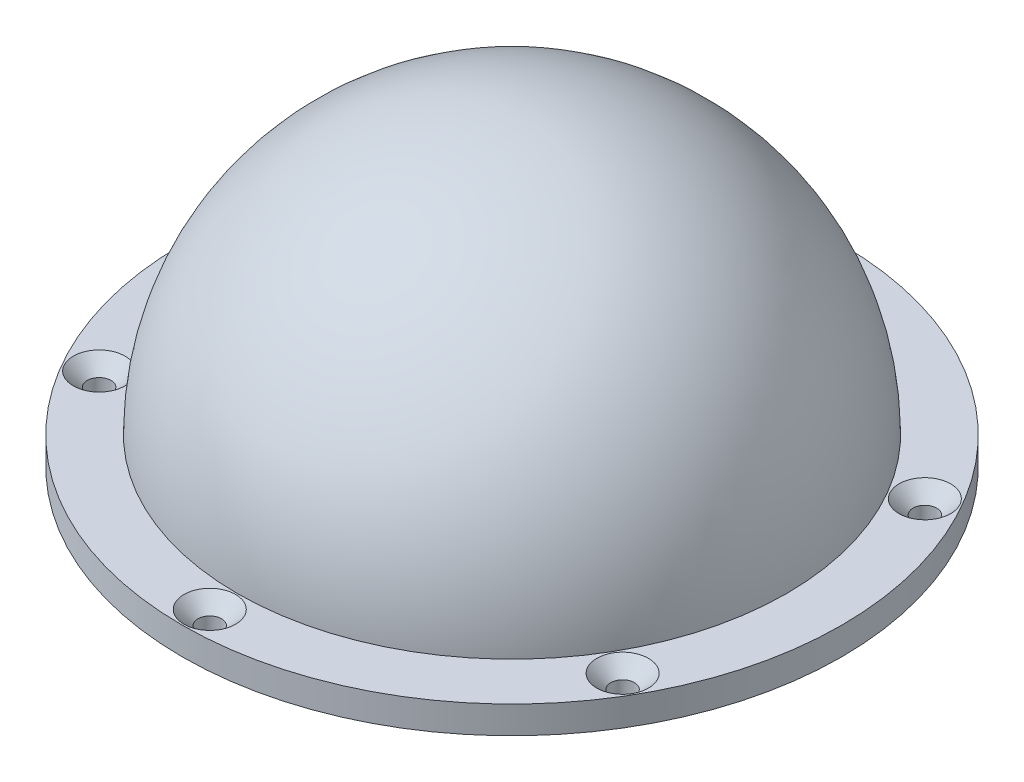
ISO-10303-21;
HEADER;
FILE_DESCRIPTION(('STEP AP214'),'2;1');
FILE_NAME('part.step','',(''),(''),'','','');
FILE_SCHEMA(('AUTOMOTIVE_DESIGN { 1 0 10303 214 1 1 1 1 }'));
ENDSEC;
DATA;
#1=APPLICATION_CONTEXT('core data for automotive mechanical design processes');
#2=APPLICATION_PROTOCOL_DEFINITION('international standard','automotive_design',2000,#1);
#3=PRODUCT_CONTEXT('',#1,'mechanical');
#4=PRODUCT('Part','Part','',(#3));
#5=PRODUCT_RELATED_PRODUCT_CATEGORY('part','',(#4));
#6=PRODUCT_DEFINITION_FORMATION('','',#4);
#7=PRODUCT_DEFINITION_CONTEXT('part definition',#1,'design');
#8=PRODUCT_DEFINITION('design','',#6,#7);
#9=PRODUCT_DEFINITION_SHAPE('','',#8);
#10=(LENGTH_UNIT() NAMED_UNIT(*) SI_UNIT(.MILLI.,.METRE.));
#11=(NAMED_UNIT(*) PLANE_ANGLE_UNIT() SI_UNIT($,.RADIAN.));
#12=(NAMED_UNIT(*) SI_UNIT($,.STERADIAN.) SOLID_ANGLE_UNIT());
#13=UNCERTAINTY_MEASURE_WITH_UNIT(LENGTH_MEASURE(1.E-05),#10,'distance_accuracy_value','');
#14=(GEOMETRIC_REPRESENTATION_CONTEXT(3) GLOBAL_UNCERTAINTY_ASSIGNED_CONTEXT((#13)) GLOBAL_UNIT_ASSIGNED_CONTEXT((#10,
#11,#12)) REPRESENTATION_CONTEXT('',''));
#15=CARTESIAN_POINT('',(0.,0.,0.));
#16=DIRECTION('',(0.,0.,1.));
#17=DIRECTION('',(1.,0.,0.));
#18=AXIS2_PLACEMENT_3D('',#15,#16,#17);
#19=CARTESIAN_POINT('',(0.,50.,0.));
#20=DIRECTION('',(0.,1.,0.));
#21=DIRECTION('',(-1.,0.,0.));
#22=AXIS2_PLACEMENT_3D('',#19,#20,#21);
#23=CYLINDRICAL_SURFACE('',#22,60.);
#24=CARTESIAN_POINT('',(0.,0.,0.));
#25=DIRECTION('',(0.,1.,0.));
#26=DIRECTION('',(-1.,0.,0.));
#27=AXIS2_PLACEMENT_3D('',#24,#25,#26);
#28=CIRCLE('',#27,60.);
#29=CARTESIAN_POINT('',(-60.,0.,0.));
#30=VERTEX_POINT('',#29);
#31=EDGE_CURVE('E10',#30,#30,#28,.T.);
#32=ORIENTED_EDGE('',*,*,#31,.F.);
#33=EDGE_LOOP('',(#32));
#34=FACE_BOUND('',#33,.T.);
#35=CARTESIAN_POINT('',(0.,-4.99999999999999,0.));
#36=DIRECTION('',(0.,1.,0.));
#37=DIRECTION('',(-1.,0.,0.));
#38=AXIS2_PLACEMENT_3D('',#35,#36,#37);
#39=CIRCLE('',#38,60.);
#40=CARTESIAN_POINT('',(-60.,-5.,0.));
#41=VERTEX_POINT('',#40);
#42=EDGE_CURVE('E39',#41,#41,#39,.T.);
#43=ORIENTED_EDGE('',*,*,#42,.T.);
#44=EDGE_LOOP('',(#43));
#45=FACE_BOUND('',#44,.T.);
#46=ADVANCED_FACE('F29',(#34,#45),#23,.T.);
#47=CARTESIAN_POINT('',(50.,0.,0.));
#48=DIRECTION('',(0.,-1.,0.));
#49=DIRECTION('',(1.,0.,0.));
#50=AXIS2_PLACEMENT_3D('',#47,#48,#49);
#51=PLANE('',#50);
#52=CARTESIAN_POINT('',(47.6313972081438,0.,-27.5000000000006));
#53=DIRECTION('',(0.,1.,0.));
#54=DIRECTION('',(0.,0.,1.));
#55=AXIS2_PLACEMENT_3D('',#52,#53,#54);
#56=CIRCLE('',#55,4.7);
#57=CARTESIAN_POINT('',(47.6313972081438,0.,-22.8000000000006));
#58=VERTEX_POINT('',#57);
#59=EDGE_CURVE('E90',#58,#58,#56,.T.);
#60=ORIENTED_EDGE('',*,*,#59,.F.);
#61=EDGE_LOOP('',(#60));
#62=FACE_BOUND('',#61,.T.);
#63=CARTESIAN_POINT('',(47.6313972081444,0.,27.4999999999996));
#64=DIRECTION('',(0.,1.,0.));
#65=DIRECTION('',(0.,0.,1.));
#66=AXIS2_PLACEMENT_3D('',#63,#64,#65);
#67=CIRCLE('',#66,4.7);
#68=CARTESIAN_POINT('',(47.6313972081444,0.,32.1999999999996));
#69=VERTEX_POINT('',#68);
#70=EDGE_CURVE('E81',#69,#69,#67,.T.);
#71=ORIENTED_EDGE('',*,*,#70,.F.);
#72=EDGE_LOOP('',(#71));
#73=FACE_BOUND('',#72,.T.);
#74=CARTESIAN_POINT('',(3.84063169722032E-13,0.,55.));
#75=DIRECTION('',(0.,1.,0.));
#76=DIRECTION('',(0.,0.,1.));
#77=AXIS2_PLACEMENT_3D('',#74,#75,#76);
#78=CIRCLE('',#77,4.7);
#79=CARTESIAN_POINT('',(3.84063169722032E-13,0.,59.7));
#80=VERTEX_POINT('',#79);
#81=EDGE_CURVE('E72',#80,#80,#78,.T.);
#82=ORIENTED_EDGE('',*,*,#81,.F.);
#83=EDGE_LOOP('',(#82));
#84=FACE_BOUND('',#83,.T.);
#85=CARTESIAN_POINT('',(-47.631397208144,0.,27.5000000000002));
#86=DIRECTION('',(0.,1.,0.));
#87=DIRECTION('',(0.,0.,1.));
#88=AXIS2_PLACEMENT_3D('',#85,#86,#87);
#89=CIRCLE('',#88,4.7);
#90=CARTESIAN_POINT('',(-47.631397208144,0.,32.2000000000002));
#91=VERTEX_POINT('',#90);
#92=EDGE_CURVE('E63',#91,#91,#89,.T.);
#93=ORIENTED_EDGE('',*,*,#92,.F.);
#94=EDGE_LOOP('',(#93));
#95=FACE_BOUND('',#94,.T.);
#96=CARTESIAN_POINT('',(-47.6313972081442,0.,-27.4999999999999));
#97=DIRECTION('',(0.,1.,0.));
#98=DIRECTION('',(0.,0.,1.));
#99=AXIS2_PLACEMENT_3D('',#96,#97,#98);
#100=CIRCLE('',#99,4.7);
#101=CARTESIAN_POINT('',(-47.6313972081442,0.,-22.7999999999999));
#102=VERTEX_POINT('',#101);
#103=EDGE_CURVE('E54',#102,#102,#100,.T.);
#104=ORIENTED_EDGE('',*,*,#103,.F.);
#105=EDGE_LOOP('',(#104));
#106=FACE_BOUND('',#105,.T.);
#107=CARTESIAN_POINT('',(0.,0.,-55.));
#108=DIRECTION('',(0.,1.,0.));
#109=DIRECTION('',(0.,0.,1.));
#110=AXIS2_PLACEMENT_3D('',#107,#108,#109);
#111=CIRCLE('',#110,4.7);
#112=CARTESIAN_POINT('',(0.,0.,-50.3));
#113=VERTEX_POINT('',#112);
#114=EDGE_CURVE('E43',#113,#113,#111,.T.);
#115=ORIENTED_EDGE('',*,*,#114,.F.);
#116=EDGE_LOOP('',(#115));
#117=FACE_BOUND('',#116,.T.);
#118=CARTESIAN_POINT('',(0.,0.,0.));
#119=DIRECTION('',(0.,1.,0.));
#120=DIRECTION('',(-1.,0.,0.));
#121=AXIS2_PLACEMENT_3D('',#118,#119,#120);
#122=CIRCLE('',#121,50.);
#123=CARTESIAN_POINT('',(-50.,0.,0.));
#124=VERTEX_POINT('',#123);
#125=EDGE_CURVE('E35',#124,#124,#122,.T.);
#126=ORIENTED_EDGE('',*,*,#125,.F.);
#127=EDGE_LOOP('',(#126));
#128=FACE_BOUND('',#127,.T.);
#129=ORIENTED_EDGE('',*,*,#31,.T.);
#130=EDGE_LOOP('',(#129));
#131=FACE_BOUND('',#130,.T.);
#132=ADVANCED_FACE('F116',(#62,#73,#84,#95,#106,#117,#128,#131),#51,.F.);
#133=CARTESIAN_POINT('',(0.,0.,0.));
#134=DIRECTION('',(0.,1.,0.));
#135=DIRECTION('',(1.,0.,0.));
#136=AXIS2_PLACEMENT_3D('',#133,#134,#135);
#137=SPHERICAL_SURFACE('',#136,50.);
#138=ORIENTED_EDGE('',*,*,#125,.T.);
#139=EDGE_LOOP('',(#138));
#140=FACE_BOUND('',#139,.T.);
#141=ADVANCED_FACE('F119',(#140),#137,.T.);
#142=CARTESIAN_POINT('',(0.,-4.99999999999999,0.));
#143=DIRECTION('',(0.,1.,0.));
#144=DIRECTION('',(-1.,0.,0.));
#145=AXIS2_PLACEMENT_3D('',#142,#143,#144);
#146=PLANE('',#145);
#147=CARTESIAN_POINT('',(47.6313972081438,-4.99999999999999,-27.5000000000006));
#148=DIRECTION('',(0.,1.,0.));
#149=DIRECTION('',(0.,0.,1.));
#150=AXIS2_PLACEMENT_3D('',#147,#148,#149);
#151=CIRCLE('',#150,2.15);
#152=CARTESIAN_POINT('',(47.6313972081438,-4.99999999999999,-25.3500000000006));
#153=VERTEX_POINT('',#152);
#154=EDGE_CURVE('E96',#153,#153,#151,.T.);
#155=ORIENTED_EDGE('',*,*,#154,.T.);
#156=EDGE_LOOP('',(#155));
#157=FACE_BOUND('',#156,.T.);
#158=CARTESIAN_POINT('',(47.6313972081444,-4.99999999999999,27.4999999999996));
#159=DIRECTION('',(0.,1.,0.));
#160=DIRECTION('',(0.,0.,1.));
#161=AXIS2_PLACEMENT_3D('',#158,#159,#160);
#162=CIRCLE('',#161,2.15);
#163=CARTESIAN_POINT('',(47.6313972081444,-4.99999999999999,29.6499999999996));
#164=VERTEX_POINT('',#163);
#165=EDGE_CURVE('E87',#164,#164,#162,.T.);
#166=ORIENTED_EDGE('',*,*,#165,.T.);
#167=EDGE_LOOP('',(#166));
#168=FACE_BOUND('',#167,.T.);
#169=CARTESIAN_POINT('',(3.84063169722032E-13,-4.99999999999999,55.));
#170=DIRECTION('',(0.,1.,0.));
#171=DIRECTION('',(0.,0.,1.));
#172=AXIS2_PLACEMENT_3D('',#169,#170,#171);
#173=CIRCLE('',#172,2.15);
#174=CARTESIAN_POINT('',(3.84063169722032E-13,-4.99999999999999,57.15));
#175=VERTEX_POINT('',#174);
#176=EDGE_CURVE('E78',#175,#175,#173,.T.);
#177=ORIENTED_EDGE('',*,*,#176,.T.);
#178=EDGE_LOOP('',(#177));
#179=FACE_BOUND('',#178,.T.);
#180=CARTESIAN_POINT('',(-47.631397208144,-4.99999999999999,27.5000000000002));
#181=DIRECTION('',(0.,1.,0.));
#182=DIRECTION('',(0.,0.,1.));
#183=AXIS2_PLACEMENT_3D('',#180,#181,#182);
#184=CIRCLE('',#183,2.15);
#185=CARTESIAN_POINT('',(-47.631397208144,-4.99999999999999,29.6500000000002));
#186=VERTEX_POINT('',#185);
#187=EDGE_CURVE('E69',#186,#186,#184,.T.);
#188=ORIENTED_EDGE('',*,*,#187,.T.);
#189=EDGE_LOOP('',(#188));
#190=FACE_BOUND('',#189,.T.);
#191=CARTESIAN_POINT('',(-47.6313972081442,-4.99999999999999,-27.4999999999999));
#192=DIRECTION('',(0.,1.,0.));
#193=DIRECTION('',(0.,0.,1.));
#194=AXIS2_PLACEMENT_3D('',#191,#192,#193);
#195=CIRCLE('',#194,2.15);
#196=CARTESIAN_POINT('',(-47.6313972081442,-4.99999999999999,-25.3499999999999));
#197=VERTEX_POINT('',#196);
#198=EDGE_CURVE('E60',#197,#197,#195,.T.);
#199=ORIENTED_EDGE('',*,*,#198,.T.);
#200=EDGE_LOOP('',(#199));
#201=FACE_BOUND('',#200,.T.);
#202=CARTESIAN_POINT('',(0.,-4.99999999999999,-55.));
#203=DIRECTION('',(0.,1.,0.));
#204=DIRECTION('',(0.,0.,1.));
#205=AXIS2_PLACEMENT_3D('',#202,#203,#204);
#206=CIRCLE('',#205,2.15);
#207=CARTESIAN_POINT('',(0.,-4.99999999999999,-52.85));
#208=VERTEX_POINT('',#207);
#209=EDGE_CURVE('E51',#208,#208,#206,.T.);
#210=ORIENTED_EDGE('',*,*,#209,.T.);
#211=EDGE_LOOP('',(#210));
#212=FACE_BOUND('',#211,.T.);
#213=ORIENTED_EDGE('',*,*,#42,.F.);
#214=EDGE_LOOP('',(#213));
#215=FACE_BOUND('',#214,.T.);
#216=ADVANCED_FACE('F100',(#157,#168,#179,#190,#201,#212,#215),#146,.F.);
#217=CARTESIAN_POINT('',(0.,0.,-55.));
#218=DIRECTION('',(0.,1.,0.));
#219=DIRECTION('',(0.,0.,1.));
#220=AXIS2_PLACEMENT_3D('',#217,#218,#219);
#221=CONICAL_SURFACE('',#220,4.7,0.785398163397449);
#222=CARTESIAN_POINT('',(0.,-2.55,-55.));
#223=DIRECTION('',(0.,1.,0.));
#224=DIRECTION('',(0.,0.,1.));
#225=AXIS2_PLACEMENT_3D('',#222,#223,#224);
#226=CIRCLE('',#225,2.15);
#227=CARTESIAN_POINT('',(0.,-2.55,-52.85));
#228=VERTEX_POINT('',#227);
#229=EDGE_CURVE('E48',#228,#228,#226,.T.);
#230=ORIENTED_EDGE('',*,*,#229,.F.);
#231=EDGE_LOOP('',(#230));
#232=FACE_BOUND('',#231,.T.);
#233=ORIENTED_EDGE('',*,*,#114,.T.);
#234=EDGE_LOOP('',(#233));
#235=FACE_BOUND('',#234,.T.);
#236=ADVANCED_FACE('F131',(#232,#235),#221,.F.);
#237=CARTESIAN_POINT('',(0.,0.,-55.));
#238=DIRECTION('',(0.,1.,0.));
#239=DIRECTION('',(0.,0.,1.));
#240=AXIS2_PLACEMENT_3D('',#237,#238,#239);
#241=CYLINDRICAL_SURFACE('',#240,2.15);
#242=ORIENTED_EDGE('',*,*,#209,.F.);
#243=EDGE_LOOP('',(#242));
#244=FACE_BOUND('',#243,.T.);
#245=ORIENTED_EDGE('',*,*,#229,.T.);
#246=EDGE_LOOP('',(#245));
#247=FACE_BOUND('',#246,.T.);
#248=ADVANCED_FACE('F133',(#244,#247),#241,.F.);
#249=CARTESIAN_POINT('',(-47.6313972081442,0.,-27.4999999999999));
#250=DIRECTION('',(0.,1.,0.));
#251=DIRECTION('',(0.,0.,1.));
#252=AXIS2_PLACEMENT_3D('',#249,#250,#251);
#253=CONICAL_SURFACE('',#252,4.7,0.785398163397449);
#254=CARTESIAN_POINT('',(-47.6313972081442,-2.55,-27.4999999999999));
#255=DIRECTION('',(0.,1.,0.));
#256=DIRECTION('',(0.,0.,1.));
#257=AXIS2_PLACEMENT_3D('',#254,#255,#256);
#258=CIRCLE('',#257,2.15);
#259=CARTESIAN_POINT('',(-47.6313972081442,-2.55,-25.3499999999999));
#260=VERTEX_POINT('',#259);
#261=EDGE_CURVE('E57',#260,#260,#258,.T.);
#262=ORIENTED_EDGE('',*,*,#261,.F.);
#263=EDGE_LOOP('',(#262));
#264=FACE_BOUND('',#263,.T.);
#265=ORIENTED_EDGE('',*,*,#103,.T.);
#266=EDGE_LOOP('',(#265));
#267=FACE_BOUND('',#266,.T.);
#268=ADVANCED_FACE('F140',(#264,#267),#253,.F.);
#269=CARTESIAN_POINT('',(-47.6313972081442,0.,-27.4999999999999));
#270=DIRECTION('',(0.,1.,0.));
#271=DIRECTION('',(0.,0.,1.));
#272=AXIS2_PLACEMENT_3D('',#269,#270,#271);
#273=CYLINDRICAL_SURFACE('',#272,2.15);
#274=ORIENTED_EDGE('',*,*,#198,.F.);
#275=EDGE_LOOP('',(#274));
#276=FACE_BOUND('',#275,.T.);
#277=ORIENTED_EDGE('',*,*,#261,.T.);
#278=EDGE_LOOP('',(#277));
#279=FACE_BOUND('',#278,.T.);
#280=ADVANCED_FACE('F177',(#276,#279),#273,.F.);
#281=CARTESIAN_POINT('',(-47.631397208144,0.,27.5000000000002));
#282=DIRECTION('',(0.,1.,0.));
#283=DIRECTION('',(0.,0.,1.));
#284=AXIS2_PLACEMENT_3D('',#281,#282,#283);
#285=CONICAL_SURFACE('',#284,4.7,0.785398163397449);
#286=CARTESIAN_POINT('',(-47.631397208144,-2.55,27.5000000000002));
#287=DIRECTION('',(0.,1.,0.));
#288=DIRECTION('',(0.,0.,1.));
#289=AXIS2_PLACEMENT_3D('',#286,#287,#288);
#290=CIRCLE('',#289,2.15);
#291=CARTESIAN_POINT('',(-47.631397208144,-2.55,29.6500000000002));
#292=VERTEX_POINT('',#291);
#293=EDGE_CURVE('E66',#292,#292,#290,.T.);
#294=ORIENTED_EDGE('',*,*,#293,.F.);
#295=EDGE_LOOP('',(#294));
#296=FACE_BOUND('',#295,.T.);
#297=ORIENTED_EDGE('',*,*,#92,.T.);
#298=EDGE_LOOP('',(#297));
#299=FACE_BOUND('',#298,.T.);
#300=ADVANCED_FACE('F188',(#296,#299),#285,.F.);
#301=CARTESIAN_POINT('',(-47.631397208144,0.,27.5000000000002));
#302=DIRECTION('',(0.,1.,0.));
#303=DIRECTION('',(0.,0.,1.));
#304=AXIS2_PLACEMENT_3D('',#301,#302,#303);
#305=CYLINDRICAL_SURFACE('',#304,2.15);
#306=ORIENTED_EDGE('',*,*,#187,.F.);
#307=EDGE_LOOP('',(#306));
#308=FACE_BOUND('',#307,.T.);
#309=ORIENTED_EDGE('',*,*,#293,.T.);
#310=EDGE_LOOP('',(#309));
#311=FACE_BOUND('',#310,.T.);
#312=ADVANCED_FACE('F198',(#308,#311),#305,.F.);
#313=CARTESIAN_POINT('',(3.84063169722032E-13,0.,55.));
#314=DIRECTION('',(0.,1.,0.));
#315=DIRECTION('',(0.,0.,1.));
#316=AXIS2_PLACEMENT_3D('',#313,#314,#315);
#317=CONICAL_SURFACE('',#316,4.7,0.785398163397449);
#318=CARTESIAN_POINT('',(3.84063169722032E-13,-2.55,55.));
#319=DIRECTION('',(0.,1.,0.));
#320=DIRECTION('',(0.,0.,1.));
#321=AXIS2_PLACEMENT_3D('',#318,#319,#320);
#322=CIRCLE('',#321,2.15);
#323=CARTESIAN_POINT('',(3.84063169722032E-13,-2.55,57.15));
#324=VERTEX_POINT('',#323);
#325=EDGE_CURVE('E75',#324,#324,#322,.T.);
#326=ORIENTED_EDGE('',*,*,#325,.F.);
#327=EDGE_LOOP('',(#326));
#328=FACE_BOUND('',#327,.T.);
#329=ORIENTED_EDGE('',*,*,#81,.T.);
#330=EDGE_LOOP('',(#329));
#331=FACE_BOUND('',#330,.T.);
#332=ADVANCED_FACE('F208',(#328,#331),#317,.F.);
#333=CARTESIAN_POINT('',(3.84063169722032E-13,0.,55.));
#334=DIRECTION('',(0.,1.,0.));
#335=DIRECTION('',(0.,0.,1.));
#336=AXIS2_PLACEMENT_3D('',#333,#334,#335);
#337=CYLINDRICAL_SURFACE('',#336,2.15);
#338=ORIENTED_EDGE('',*,*,#176,.F.);
#339=EDGE_LOOP('',(#338));
#340=FACE_BOUND('',#339,.T.);
#341=ORIENTED_EDGE('',*,*,#325,.T.);
#342=EDGE_LOOP('',(#341));
#343=FACE_BOUND('',#342,.T.);
#344=ADVANCED_FACE('F218',(#340,#343),#337,.F.);
#345=CARTESIAN_POINT('',(47.6313972081444,0.,27.4999999999996));
#346=DIRECTION('',(0.,1.,0.));
#347=DIRECTION('',(0.,0.,1.));
#348=AXIS2_PLACEMENT_3D('',#345,#346,#347);
#349=CONICAL_SURFACE('',#348,4.7,0.785398163397449);
#350=CARTESIAN_POINT('',(47.6313972081444,-2.55,27.4999999999996));
#351=DIRECTION('',(0.,1.,0.));
#352=DIRECTION('',(0.,0.,1.));
#353=AXIS2_PLACEMENT_3D('',#350,#351,#352);
#354=CIRCLE('',#353,2.15);
#355=CARTESIAN_POINT('',(47.6313972081444,-2.55,29.6499999999996));
#356=VERTEX_POINT('',#355);
#357=EDGE_CURVE('E84',#356,#356,#354,.T.);
#358=ORIENTED_EDGE('',*,*,#357,.F.);
#359=EDGE_LOOP('',(#358));
#360=FACE_BOUND('',#359,.T.);
#361=ORIENTED_EDGE('',*,*,#70,.T.);
#362=EDGE_LOOP('',(#361));
#363=FACE_BOUND('',#362,.T.);
#364=ADVANCED_FACE('F228',(#360,#363),#349,.F.);
#365=CARTESIAN_POINT('',(47.6313972081444,0.,27.4999999999996));
#366=DIRECTION('',(0.,1.,0.));
#367=DIRECTION('',(0.,0.,1.));
#368=AXIS2_PLACEMENT_3D('',#365,#366,#367);
#369=CYLINDRICAL_SURFACE('',#368,2.15);
#370=ORIENTED_EDGE('',*,*,#165,.F.);
#371=EDGE_LOOP('',(#370));
#372=FACE_BOUND('',#371,.T.);
#373=ORIENTED_EDGE('',*,*,#357,.T.);
#374=EDGE_LOOP('',(#373));
#375=FACE_BOUND('',#374,.T.);
#376=ADVANCED_FACE('F112',(#372,#375),#369,.F.);
#377=CARTESIAN_POINT('',(47.6313972081438,0.,-27.5000000000006));
#378=DIRECTION('',(0.,1.,0.));
#379=DIRECTION('',(0.,0.,1.));
#380=AXIS2_PLACEMENT_3D('',#377,#378,#379);
#381=CONICAL_SURFACE('',#380,4.7,0.785398163397449);
#382=CARTESIAN_POINT('',(47.6313972081438,-2.55,-27.5000000000006));
#383=DIRECTION('',(0.,1.,0.));
#384=DIRECTION('',(0.,0.,1.));
#385=AXIS2_PLACEMENT_3D('',#382,#383,#384);
#386=CIRCLE('',#385,2.15);
#387=CARTESIAN_POINT('',(47.6313972081438,-2.55,-25.3500000000006));
#388=VERTEX_POINT('',#387);
#389=EDGE_CURVE('E93',#388,#388,#386,.T.);
#390=ORIENTED_EDGE('',*,*,#389,.F.);
#391=EDGE_LOOP('',(#390));
#392=FACE_BOUND('',#391,.T.);
#393=ORIENTED_EDGE('',*,*,#59,.T.);
#394=EDGE_LOOP('',(#393));
#395=FACE_BOUND('',#394,.T.);
#396=ADVANCED_FACE('F106',(#392,#395),#381,.F.);
#397=CARTESIAN_POINT('',(47.6313972081438,0.,-27.5000000000006));
#398=DIRECTION('',(0.,1.,0.));
#399=DIRECTION('',(0.,0.,1.));
#400=AXIS2_PLACEMENT_3D('',#397,#398,#399);
#401=CYLINDRICAL_SURFACE('',#400,2.15);
#402=ORIENTED_EDGE('',*,*,#154,.F.);
#403=EDGE_LOOP('',(#402));
#404=FACE_BOUND('',#403,.T.);
#405=ORIENTED_EDGE('',*,*,#389,.T.);
#406=EDGE_LOOP('',(#405));
#407=FACE_BOUND('',#406,.T.);
#408=ADVANCED_FACE('F103',(#404,#407),#401,.F.);
#409=CLOSED_SHELL('',(#46,#132,#141,#216,#236,#248,#268,#280,#300,#312,#332,#344,#364,#376,#396,#408));
#410=MANIFOLD_SOLID_BREP('B2',#409);
#411=ADVANCED_BREP_SHAPE_REPRESENTATION('',(#18,#410),#14);
#412=SHAPE_DEFINITION_REPRESENTATION(#9,#411);
ENDSEC;
END-ISO-10303-21;
